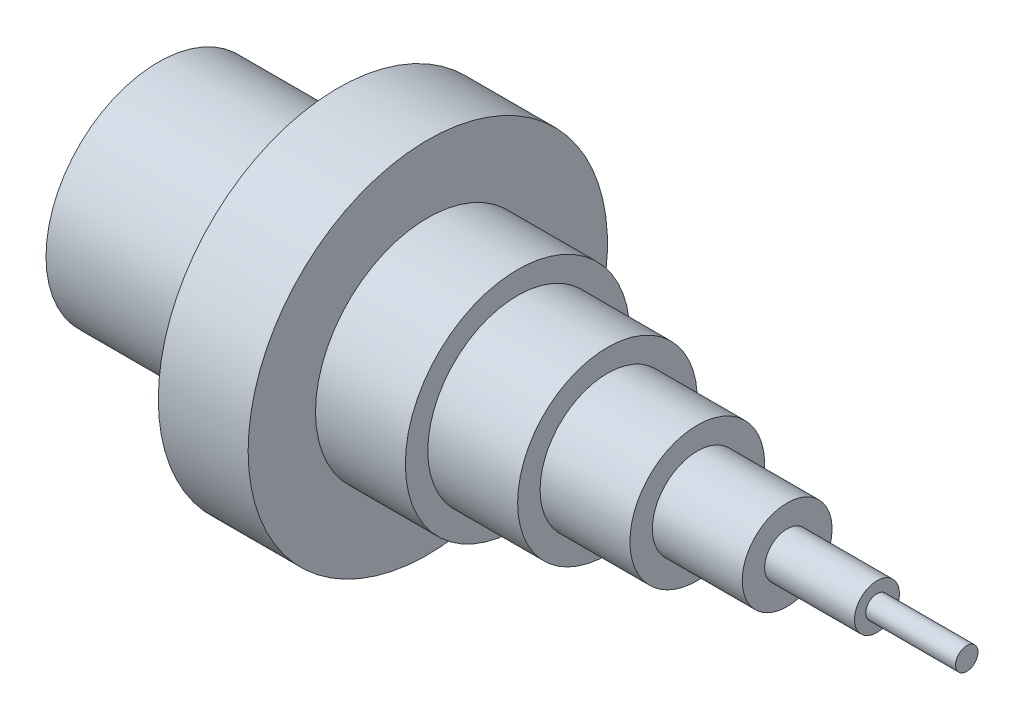
ISO-10303-21;
HEADER;
FILE_DESCRIPTION(('STEP AP214'),'2;1');
FILE_NAME('part.step','',(''),(''),'','','');
FILE_SCHEMA(('AUTOMOTIVE_DESIGN { 1 0 10303 214 1 1 1 1 }'));
ENDSEC;
DATA;
#1=APPLICATION_CONTEXT('core data for automotive mechanical design processes');
#2=APPLICATION_PROTOCOL_DEFINITION('international standard','automotive_design',2000,#1);
#3=PRODUCT_CONTEXT('',#1,'mechanical');
#4=PRODUCT('Part','Part','',(#3));
#5=PRODUCT_RELATED_PRODUCT_CATEGORY('part','',(#4));
#6=PRODUCT_DEFINITION_FORMATION('','',#4);
#7=PRODUCT_DEFINITION_CONTEXT('part definition',#1,'design');
#8=PRODUCT_DEFINITION('design','',#6,#7);
#9=PRODUCT_DEFINITION_SHAPE('','',#8);
#10=(LENGTH_UNIT() NAMED_UNIT(*) SI_UNIT(.MILLI.,.METRE.));
#11=(NAMED_UNIT(*) PLANE_ANGLE_UNIT() SI_UNIT($,.RADIAN.));
#12=(NAMED_UNIT(*) SI_UNIT($,.STERADIAN.) SOLID_ANGLE_UNIT());
#13=UNCERTAINTY_MEASURE_WITH_UNIT(LENGTH_MEASURE(1.E-05),#10,'distance_accuracy_value','');
#14=(GEOMETRIC_REPRESENTATION_CONTEXT(3) GLOBAL_UNCERTAINTY_ASSIGNED_CONTEXT((#13)) GLOBAL_UNIT_ASSIGNED_CONTEXT((#10,
#11,#12)) REPRESENTATION_CONTEXT('',''));
#15=CARTESIAN_POINT('',(0.,0.,0.));
#16=DIRECTION('',(0.,0.,1.));
#17=DIRECTION('',(1.,0.,0.));
#18=AXIS2_PLACEMENT_3D('',#15,#16,#17);
#19=CARTESIAN_POINT('',(0.,0.,0.));
#20=DIRECTION('',(1.,0.,0.));
#21=DIRECTION('',(0.,0.,-1.));
#22=AXIS2_PLACEMENT_3D('',#19,#20,#21);
#23=PLANE('',#22);
#24=CARTESIAN_POINT('',(0.,0.,0.));
#25=DIRECTION('',(-1.,0.,0.));
#26=DIRECTION('',(0.,0.,1.));
#27=AXIS2_PLACEMENT_3D('',#24,#25,#26);
#28=CIRCLE('',#27,20.);
#29=CARTESIAN_POINT('',(0.,0.,20.));
#30=VERTEX_POINT('',#29);
#31=EDGE_CURVE('E87',#30,#30,#28,.T.);
#32=ORIENTED_EDGE('',*,*,#31,.F.);
#33=EDGE_LOOP('',(#32));
#34=FACE_BOUND('',#33,.T.);
#35=CARTESIAN_POINT('',(0.,0.,0.));
#36=DIRECTION('',(-1.,0.,0.));
#37=DIRECTION('',(0.,0.,1.));
#38=AXIS2_PLACEMENT_3D('',#35,#36,#37);
#39=CIRCLE('',#38,25.);
#40=CARTESIAN_POINT('',(0.,0.,25.));
#41=VERTEX_POINT('',#40);
#42=EDGE_CURVE('E10',#41,#41,#39,.T.);
#43=ORIENTED_EDGE('',*,*,#42,.T.);
#44=EDGE_LOOP('',(#43));
#45=FACE_BOUND('',#44,.T.);
#46=ADVANCED_FACE('F31',(#34,#45),#23,.F.);
#47=CARTESIAN_POINT('',(-28.8888888888889,0.,0.));
#48=DIRECTION('',(-1.,0.,0.));
#49=DIRECTION('',(0.,0.,1.));
#50=AXIS2_PLACEMENT_3D('',#47,#48,#49);
#51=CYLINDRICAL_SURFACE('',#50,25.);
#52=ORIENTED_EDGE('',*,*,#42,.F.);
#53=EDGE_LOOP('',(#52));
#54=FACE_BOUND('',#53,.T.);
#55=CARTESIAN_POINT('',(40.,0.,0.));
#56=DIRECTION('',(-1.,0.,0.));
#57=DIRECTION('',(0.,0.,1.));
#58=AXIS2_PLACEMENT_3D('',#55,#56,#57);
#59=CIRCLE('',#58,25.);
#60=CARTESIAN_POINT('',(40.,0.,25.));
#61=VERTEX_POINT('',#60);
#62=EDGE_CURVE('E37',#61,#61,#59,.T.);
#63=ORIENTED_EDGE('',*,*,#62,.T.);
#64=EDGE_LOOP('',(#63));
#65=FACE_BOUND('',#64,.T.);
#66=ADVANCED_FACE('F103',(#54,#65),#51,.T.);
#67=CARTESIAN_POINT('',(40.,0.,-25.));
#68=DIRECTION('',(1.,0.,0.));
#69=DIRECTION('',(0.,0.,-1.));
#70=AXIS2_PLACEMENT_3D('',#67,#68,#69);
#71=PLANE('',#70);
#72=ORIENTED_EDGE('',*,*,#62,.F.);
#73=EDGE_LOOP('',(#72));
#74=FACE_BOUND('',#73,.T.);
#75=CARTESIAN_POINT('',(40.,0.,0.));
#76=DIRECTION('',(-1.,0.,0.));
#77=DIRECTION('',(0.,0.,1.));
#78=AXIS2_PLACEMENT_3D('',#75,#76,#77);
#79=CIRCLE('',#78,40.);
#80=CARTESIAN_POINT('',(40.,0.,40.));
#81=VERTEX_POINT('',#80);
#82=EDGE_CURVE('E41',#81,#81,#79,.T.);
#83=ORIENTED_EDGE('',*,*,#82,.T.);
#84=EDGE_LOOP('',(#83));
#85=FACE_BOUND('',#84,.T.);
#86=ADVANCED_FACE('F107',(#74,#85),#71,.F.);
#87=CARTESIAN_POINT('',(-28.8888888888889,0.,0.));
#88=DIRECTION('',(-1.,0.,0.));
#89=DIRECTION('',(0.,0.,1.));
#90=AXIS2_PLACEMENT_3D('',#87,#88,#89);
#91=CYLINDRICAL_SURFACE('',#90,40.);
#92=ORIENTED_EDGE('',*,*,#82,.F.);
#93=EDGE_LOOP('',(#92));
#94=FACE_BOUND('',#93,.T.);
#95=CARTESIAN_POINT('',(60.,0.,0.));
#96=DIRECTION('',(-1.,0.,0.));
#97=DIRECTION('',(0.,0.,1.));
#98=AXIS2_PLACEMENT_3D('',#95,#96,#97);
#99=CIRCLE('',#98,40.);
#100=CARTESIAN_POINT('',(60.,0.,40.));
#101=VERTEX_POINT('',#100);
#102=EDGE_CURVE('E45',#101,#101,#99,.T.);
#103=ORIENTED_EDGE('',*,*,#102,.T.);
#104=EDGE_LOOP('',(#103));
#105=FACE_BOUND('',#104,.T.);
#106=ADVANCED_FACE('F112',(#94,#105),#91,.T.);
#107=CARTESIAN_POINT('',(60.,0.,-40.));
#108=DIRECTION('',(-1.,0.,0.));
#109=DIRECTION('',(0.,0.,1.));
#110=AXIS2_PLACEMENT_3D('',#107,#108,#109);
#111=PLANE('',#110);
#112=ORIENTED_EDGE('',*,*,#102,.F.);
#113=EDGE_LOOP('',(#112));
#114=FACE_BOUND('',#113,.T.);
#115=CARTESIAN_POINT('',(60.,0.,0.));
#116=DIRECTION('',(-1.,0.,0.));
#117=DIRECTION('',(0.,0.,1.));
#118=AXIS2_PLACEMENT_3D('',#115,#116,#117);
#119=CIRCLE('',#118,25.);
#120=CARTESIAN_POINT('',(60.,0.,25.));
#121=VERTEX_POINT('',#120);
#122=EDGE_CURVE('E50',#121,#121,#119,.T.);
#123=ORIENTED_EDGE('',*,*,#122,.T.);
#124=EDGE_LOOP('',(#123));
#125=FACE_BOUND('',#124,.T.);
#126=ADVANCED_FACE('F118',(#114,#125),#111,.F.);
#127=CARTESIAN_POINT('',(-28.8888888888889,0.,0.));
#128=DIRECTION('',(-1.,0.,0.));
#129=DIRECTION('',(0.,0.,1.));
#130=AXIS2_PLACEMENT_3D('',#127,#128,#129);
#131=CYLINDRICAL_SURFACE('',#130,25.);
#132=ORIENTED_EDGE('',*,*,#122,.F.);
#133=EDGE_LOOP('',(#132));
#134=FACE_BOUND('',#133,.T.);
#135=CARTESIAN_POINT('',(80.,0.,0.));
#136=DIRECTION('',(-1.,0.,0.));
#137=DIRECTION('',(0.,0.,1.));
#138=AXIS2_PLACEMENT_3D('',#135,#136,#137);
#139=CIRCLE('',#138,25.);
#140=CARTESIAN_POINT('',(80.,0.,25.));
#141=VERTEX_POINT('',#140);
#142=EDGE_CURVE('E53',#141,#141,#139,.T.);
#143=ORIENTED_EDGE('',*,*,#142,.T.);
#144=EDGE_LOOP('',(#143));
#145=FACE_BOUND('',#144,.T.);
#146=ADVANCED_FACE('F122',(#134,#145),#131,.T.);
#147=CARTESIAN_POINT('',(80.,0.,-25.));
#148=DIRECTION('',(-1.,0.,0.));
#149=DIRECTION('',(0.,0.,1.));
#150=AXIS2_PLACEMENT_3D('',#147,#148,#149);
#151=PLANE('',#150);
#152=ORIENTED_EDGE('',*,*,#142,.F.);
#153=EDGE_LOOP('',(#152));
#154=FACE_BOUND('',#153,.T.);
#155=CARTESIAN_POINT('',(80.,0.,0.));
#156=DIRECTION('',(-1.,0.,0.));
#157=DIRECTION('',(0.,0.,1.));
#158=AXIS2_PLACEMENT_3D('',#155,#156,#157);
#159=CIRCLE('',#158,20.);
#160=CARTESIAN_POINT('',(80.,0.,20.));
#161=VERTEX_POINT('',#160);
#162=EDGE_CURVE('E56',#161,#161,#159,.T.);
#163=ORIENTED_EDGE('',*,*,#162,.T.);
#164=EDGE_LOOP('',(#163));
#165=FACE_BOUND('',#164,.T.);
#166=ADVANCED_FACE('F126',(#154,#165),#151,.F.);
#167=CARTESIAN_POINT('',(-28.8888888888889,0.,0.));
#168=DIRECTION('',(-1.,0.,0.));
#169=DIRECTION('',(0.,0.,1.));
#170=AXIS2_PLACEMENT_3D('',#167,#168,#169);
#171=CYLINDRICAL_SURFACE('',#170,20.);
#172=ORIENTED_EDGE('',*,*,#162,.F.);
#173=EDGE_LOOP('',(#172));
#174=FACE_BOUND('',#173,.T.);
#175=CARTESIAN_POINT('',(100.,0.,0.));
#176=DIRECTION('',(-1.,0.,0.));
#177=DIRECTION('',(0.,0.,1.));
#178=AXIS2_PLACEMENT_3D('',#175,#176,#177);
#179=CIRCLE('',#178,20.);
#180=CARTESIAN_POINT('',(100.,0.,20.));
#181=VERTEX_POINT('',#180);
#182=EDGE_CURVE('E59',#181,#181,#179,.T.);
#183=ORIENTED_EDGE('',*,*,#182,.T.);
#184=EDGE_LOOP('',(#183));
#185=FACE_BOUND('',#184,.T.);
#186=ADVANCED_FACE('F130',(#174,#185),#171,.T.);
#187=CARTESIAN_POINT('',(100.,0.,-20.));
#188=DIRECTION('',(-1.,0.,0.));
#189=DIRECTION('',(0.,0.,1.));
#190=AXIS2_PLACEMENT_3D('',#187,#188,#189);
#191=PLANE('',#190);
#192=ORIENTED_EDGE('',*,*,#182,.F.);
#193=EDGE_LOOP('',(#192));
#194=FACE_BOUND('',#193,.T.);
#195=CARTESIAN_POINT('',(100.,0.,0.));
#196=DIRECTION('',(-1.,0.,0.));
#197=DIRECTION('',(0.,0.,1.));
#198=AXIS2_PLACEMENT_3D('',#195,#196,#197);
#199=CIRCLE('',#198,15.);
#200=CARTESIAN_POINT('',(100.,0.,15.));
#201=VERTEX_POINT('',#200);
#202=EDGE_CURVE('E62',#201,#201,#199,.T.);
#203=ORIENTED_EDGE('',*,*,#202,.T.);
#204=EDGE_LOOP('',(#203));
#205=FACE_BOUND('',#204,.T.);
#206=ADVANCED_FACE('F134',(#194,#205),#191,.F.);
#207=CARTESIAN_POINT('',(-28.8888888888889,0.,0.));
#208=DIRECTION('',(-1.,0.,0.));
#209=DIRECTION('',(0.,0.,1.));
#210=AXIS2_PLACEMENT_3D('',#207,#208,#209);
#211=CYLINDRICAL_SURFACE('',#210,15.);
#212=ORIENTED_EDGE('',*,*,#202,.F.);
#213=EDGE_LOOP('',(#212));
#214=FACE_BOUND('',#213,.T.);
#215=CARTESIAN_POINT('',(120.,0.,0.));
#216=DIRECTION('',(-1.,0.,0.));
#217=DIRECTION('',(0.,0.,1.));
#218=AXIS2_PLACEMENT_3D('',#215,#216,#217);
#219=CIRCLE('',#218,15.);
#220=CARTESIAN_POINT('',(120.,0.,15.));
#221=VERTEX_POINT('',#220);
#222=EDGE_CURVE('E65',#221,#221,#219,.T.);
#223=ORIENTED_EDGE('',*,*,#222,.T.);
#224=EDGE_LOOP('',(#223));
#225=FACE_BOUND('',#224,.T.);
#226=ADVANCED_FACE('F138',(#214,#225),#211,.T.);
#227=CARTESIAN_POINT('',(120.,0.,-15.));
#228=DIRECTION('',(-1.,0.,0.));
#229=DIRECTION('',(0.,0.,1.));
#230=AXIS2_PLACEMENT_3D('',#227,#228,#229);
#231=PLANE('',#230);
#232=ORIENTED_EDGE('',*,*,#222,.F.);
#233=EDGE_LOOP('',(#232));
#234=FACE_BOUND('',#233,.T.);
#235=CARTESIAN_POINT('',(120.,0.,0.));
#236=DIRECTION('',(-1.,0.,0.));
#237=DIRECTION('',(0.,0.,1.));
#238=AXIS2_PLACEMENT_3D('',#235,#236,#237);
#239=CIRCLE('',#238,9.99999999999999);
#240=CARTESIAN_POINT('',(120.,0.,9.99999999999999));
#241=VERTEX_POINT('',#240);
#242=EDGE_CURVE('E68',#241,#241,#239,.T.);
#243=ORIENTED_EDGE('',*,*,#242,.T.);
#244=EDGE_LOOP('',(#243));
#245=FACE_BOUND('',#244,.T.);
#246=ADVANCED_FACE('F142',(#234,#245),#231,.F.);
#247=CARTESIAN_POINT('',(-28.8888888888889,0.,0.));
#248=DIRECTION('',(-1.,0.,0.));
#249=DIRECTION('',(0.,0.,1.));
#250=AXIS2_PLACEMENT_3D('',#247,#248,#249);
#251=CYLINDRICAL_SURFACE('',#250,9.99999999999999);
#252=ORIENTED_EDGE('',*,*,#242,.F.);
#253=EDGE_LOOP('',(#252));
#254=FACE_BOUND('',#253,.T.);
#255=CARTESIAN_POINT('',(140.,0.,0.));
#256=DIRECTION('',(-1.,0.,0.));
#257=DIRECTION('',(0.,0.,1.));
#258=AXIS2_PLACEMENT_3D('',#255,#256,#257);
#259=CIRCLE('',#258,9.99999999999999);
#260=CARTESIAN_POINT('',(140.,0.,9.99999999999999));
#261=VERTEX_POINT('',#260);
#262=EDGE_CURVE('E71',#261,#261,#259,.T.);
#263=ORIENTED_EDGE('',*,*,#262,.T.);
#264=EDGE_LOOP('',(#263));
#265=FACE_BOUND('',#264,.T.);
#266=ADVANCED_FACE('F146',(#254,#265),#251,.T.);
#267=CARTESIAN_POINT('',(140.,0.,-9.99999999999999));
#268=DIRECTION('',(-1.,0.,0.));
#269=DIRECTION('',(0.,0.,1.));
#270=AXIS2_PLACEMENT_3D('',#267,#268,#269);
#271=PLANE('',#270);
#272=ORIENTED_EDGE('',*,*,#262,.F.);
#273=EDGE_LOOP('',(#272));
#274=FACE_BOUND('',#273,.T.);
#275=CARTESIAN_POINT('',(140.,0.,0.));
#276=DIRECTION('',(-1.,0.,0.));
#277=DIRECTION('',(0.,0.,1.));
#278=AXIS2_PLACEMENT_3D('',#275,#276,#277);
#279=CIRCLE('',#278,4.99999999999999);
#280=CARTESIAN_POINT('',(140.,0.,4.99999999999999));
#281=VERTEX_POINT('',#280);
#282=EDGE_CURVE('E74',#281,#281,#279,.T.);
#283=ORIENTED_EDGE('',*,*,#282,.T.);
#284=EDGE_LOOP('',(#283));
#285=FACE_BOUND('',#284,.T.);
#286=ADVANCED_FACE('F150',(#274,#285),#271,.F.);
#287=CARTESIAN_POINT('',(-28.8888888888889,0.,0.));
#288=DIRECTION('',(-1.,0.,0.));
#289=DIRECTION('',(0.,0.,1.));
#290=AXIS2_PLACEMENT_3D('',#287,#288,#289);
#291=CYLINDRICAL_SURFACE('',#290,4.99999999999999);
#292=ORIENTED_EDGE('',*,*,#282,.F.);
#293=EDGE_LOOP('',(#292));
#294=FACE_BOUND('',#293,.T.);
#295=CARTESIAN_POINT('',(160.,0.,0.));
#296=DIRECTION('',(-1.,0.,0.));
#297=DIRECTION('',(0.,0.,1.));
#298=AXIS2_PLACEMENT_3D('',#295,#296,#297);
#299=CIRCLE('',#298,4.99999999999999);
#300=CARTESIAN_POINT('',(160.,0.,4.99999999999999));
#301=VERTEX_POINT('',#300);
#302=EDGE_CURVE('E77',#301,#301,#299,.T.);
#303=ORIENTED_EDGE('',*,*,#302,.T.);
#304=EDGE_LOOP('',(#303));
#305=FACE_BOUND('',#304,.T.);
#306=ADVANCED_FACE('F154',(#294,#305),#291,.T.);
#307=CARTESIAN_POINT('',(160.,0.,-4.99999999999999));
#308=DIRECTION('',(-1.,0.,0.));
#309=DIRECTION('',(0.,0.,1.));
#310=AXIS2_PLACEMENT_3D('',#307,#308,#309);
#311=PLANE('',#310);
#312=ORIENTED_EDGE('',*,*,#302,.F.);
#313=EDGE_LOOP('',(#312));
#314=FACE_BOUND('',#313,.T.);
#315=CARTESIAN_POINT('',(160.,0.,0.));
#316=DIRECTION('',(-1.,0.,0.));
#317=DIRECTION('',(0.,0.,1.));
#318=AXIS2_PLACEMENT_3D('',#315,#316,#317);
#319=CIRCLE('',#318,2.5);
#320=CARTESIAN_POINT('',(160.,0.,2.5));
#321=VERTEX_POINT('',#320);
#322=EDGE_CURVE('E80',#321,#321,#319,.T.);
#323=ORIENTED_EDGE('',*,*,#322,.T.);
#324=EDGE_LOOP('',(#323));
#325=FACE_BOUND('',#324,.T.);
#326=ADVANCED_FACE('F158',(#314,#325),#311,.F.);
#327=CARTESIAN_POINT('',(-28.8888888888889,0.,0.));
#328=DIRECTION('',(-1.,0.,0.));
#329=DIRECTION('',(0.,0.,1.));
#330=AXIS2_PLACEMENT_3D('',#327,#328,#329);
#331=CYLINDRICAL_SURFACE('',#330,2.5);
#332=ORIENTED_EDGE('',*,*,#322,.F.);
#333=EDGE_LOOP('',(#332));
#334=FACE_BOUND('',#333,.T.);
#335=CARTESIAN_POINT('',(180.,0.,0.));
#336=DIRECTION('',(-1.,0.,0.));
#337=DIRECTION('',(0.,0.,1.));
#338=AXIS2_PLACEMENT_3D('',#335,#336,#337);
#339=CIRCLE('',#338,2.5);
#340=CARTESIAN_POINT('',(180.,0.,2.5));
#341=VERTEX_POINT('',#340);
#342=EDGE_CURVE('E83',#341,#341,#339,.T.);
#343=ORIENTED_EDGE('',*,*,#342,.T.);
#344=EDGE_LOOP('',(#343));
#345=FACE_BOUND('',#344,.T.);
#346=ADVANCED_FACE('F162',(#334,#345),#331,.T.);
#347=CARTESIAN_POINT('',(180.,0.,-2.5));
#348=DIRECTION('',(-1.,0.,0.));
#349=DIRECTION('',(0.,0.,1.));
#350=AXIS2_PLACEMENT_3D('',#347,#348,#349);
#351=PLANE('',#350);
#352=ORIENTED_EDGE('',*,*,#342,.F.);
#353=EDGE_LOOP('',(#352));
#354=FACE_BOUND('',#353,.T.);
#355=ADVANCED_FACE('F98',(#354),#351,.F.);
#356=CARTESIAN_POINT('',(40.,0.,0.));
#357=DIRECTION('',(-1.,0.,0.));
#358=DIRECTION('',(0.,0.,1.));
#359=AXIS2_PLACEMENT_3D('',#356,#357,#358);
#360=CYLINDRICAL_SURFACE('',#359,20.);
#361=CARTESIAN_POINT('',(40.,0.,0.));
#362=DIRECTION('',(-1.,0.,0.));
#363=DIRECTION('',(0.,0.,1.));
#364=AXIS2_PLACEMENT_3D('',#361,#362,#363);
#365=CIRCLE('',#364,20.);
#366=CARTESIAN_POINT('',(40.,0.,20.));
#367=VERTEX_POINT('',#366);
#368=EDGE_CURVE('E86',#367,#367,#365,.T.);
#369=ORIENTED_EDGE('',*,*,#368,.F.);
#370=EDGE_LOOP('',(#369));
#371=FACE_BOUND('',#370,.T.);
#372=ORIENTED_EDGE('',*,*,#31,.T.);
#373=EDGE_LOOP('',(#372));
#374=FACE_BOUND('',#373,.T.);
#375=ADVANCED_FACE('F95',(#371,#374),#360,.F.);
#376=CARTESIAN_POINT('',(40.,0.,0.));
#377=DIRECTION('',(-1.,0.,0.));
#378=DIRECTION('',(0.,0.,1.));
#379=AXIS2_PLACEMENT_3D('',#376,#377,#378);
#380=PLANE('',#379);
#381=ORIENTED_EDGE('',*,*,#368,.T.);
#382=EDGE_LOOP('',(#381));
#383=FACE_BOUND('',#382,.T.);
#384=ADVANCED_FACE('F93',(#383),#380,.T.);
#385=CLOSED_SHELL('',(#46,#66,#86,#106,#126,#146,#166,#186,#206,#226,#246,#266,#286,#306,#326,
#346,#355,#375,#384));
#386=MANIFOLD_SOLID_BREP('B2',#385);
#387=ADVANCED_BREP_SHAPE_REPRESENTATION('',(#18,#386),#14);
#388=SHAPE_DEFINITION_REPRESENTATION(#9,#387);
ENDSEC;
END-ISO-10303-21;
